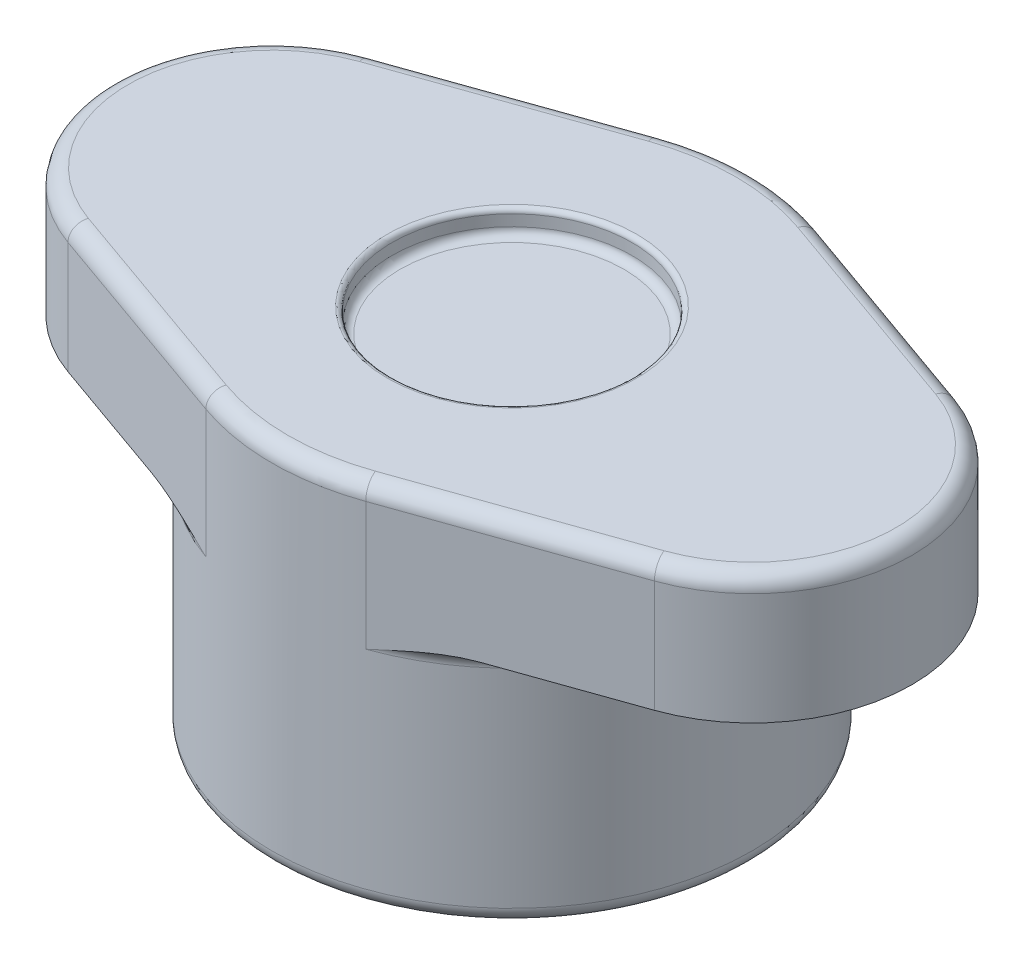
ISO-10303-21;
HEADER;
FILE_DESCRIPTION(('STEP AP214'),'2;1');
FILE_NAME('part.step','',(''),(''),'','','');
FILE_SCHEMA(('AUTOMOTIVE_DESIGN { 1 0 10303 214 1 1 1 1 }'));
ENDSEC;
DATA;
#1=APPLICATION_CONTEXT('core data for automotive mechanical design processes');
#2=APPLICATION_PROTOCOL_DEFINITION('international standard','automotive_design',2000,#1);
#3=PRODUCT_CONTEXT('',#1,'mechanical');
#4=PRODUCT('Part','Part','',(#3));
#5=PRODUCT_RELATED_PRODUCT_CATEGORY('part','',(#4));
#6=PRODUCT_DEFINITION_FORMATION('','',#4);
#7=PRODUCT_DEFINITION_CONTEXT('part definition',#1,'design');
#8=PRODUCT_DEFINITION('design','',#6,#7);
#9=PRODUCT_DEFINITION_SHAPE('','',#8);
#10=(LENGTH_UNIT() NAMED_UNIT(*) SI_UNIT(.MILLI.,.METRE.));
#11=(NAMED_UNIT(*) PLANE_ANGLE_UNIT() SI_UNIT($,.RADIAN.));
#12=(NAMED_UNIT(*) SI_UNIT($,.STERADIAN.) SOLID_ANGLE_UNIT());
#13=UNCERTAINTY_MEASURE_WITH_UNIT(LENGTH_MEASURE(1.E-05),#10,'distance_accuracy_value','');
#14=(GEOMETRIC_REPRESENTATION_CONTEXT(3) GLOBAL_UNCERTAINTY_ASSIGNED_CONTEXT((#13)) GLOBAL_UNIT_ASSIGNED_CONTEXT((#10,
#11,#12)) REPRESENTATION_CONTEXT('',''));
#15=CARTESIAN_POINT('',(0.,0.,0.));
#16=DIRECTION('',(0.,0.,1.));
#17=DIRECTION('',(1.,0.,0.));
#18=AXIS2_PLACEMENT_3D('',#15,#16,#17);
#19=CARTESIAN_POINT('',(0.,15.,0.));
#20=DIRECTION('',(0.,-1.,0.));
#21=DIRECTION('',(0.,0.,-1.));
#22=AXIS2_PLACEMENT_3D('',#19,#20,#21);
#23=CYLINDRICAL_SURFACE('',#22,15.);
#24=CARTESIAN_POINT('',(0.,1.,0.));
#25=DIRECTION('',(0.,1.,0.));
#26=DIRECTION('',(0.,0.,1.));
#27=AXIS2_PLACEMENT_3D('',#24,#25,#26);
#28=CIRCLE('',#27,15.);
#29=CARTESIAN_POINT('',(0.,1.,15.));
#30=VERTEX_POINT('',#29);
#31=EDGE_CURVE('E197',#30,#30,#28,.T.);
#32=ORIENTED_EDGE('',*,*,#31,.T.);
#33=EDGE_LOOP('',(#32));
#34=FACE_BOUND('',#33,.T.);
#35=DIRECTION('',(0.,-1.,0.));
#36=VECTOR('',#35,1.);
#37=CARTESIAN_POINT('',(-5.,23.,-14.142135623731));
#38=LINE('',#37,#36);
#39=CARTESIAN_POINT('',(-5.,22.,-14.142135623731));
#40=VERTEX_POINT('',#39);
#41=CARTESIAN_POINT('',(-5.,14.,-14.142135623731));
#42=VERTEX_POINT('',#41);
#43=EDGE_CURVE('E56',#40,#42,#38,.T.);
#44=ORIENTED_EDGE('',*,*,#43,.F.);
#45=CARTESIAN_POINT('',(0.,22.,0.));
#46=DIRECTION('',(0.,1.,0.));
#47=DIRECTION('',(0.,0.,1.));
#48=AXIS2_PLACEMENT_3D('',#45,#46,#47);
#49=CIRCLE('',#48,15.);
#50=CARTESIAN_POINT('',(5.,22.,-14.1421356237309));
#51=VERTEX_POINT('',#50);
#52=EDGE_CURVE('E195',#40,#51,#49,.F.);
#53=ORIENTED_EDGE('',*,*,#52,.T.);
#54=DIRECTION('',(0.,-1.,0.));
#55=VECTOR('',#54,1.);
#56=CARTESIAN_POINT('',(5.,23.,-14.1421356237309));
#57=LINE('',#56,#55);
#58=CARTESIAN_POINT('',(5.,14.,-14.142135623731));
#59=VERTEX_POINT('',#58);
#60=EDGE_CURVE('E174',#51,#59,#57,.T.);
#61=ORIENTED_EDGE('',*,*,#60,.T.);
#62=CARTESIAN_POINT('',(0.,14.,0.));
#63=DIRECTION('',(0.,1.,0.));
#64=DIRECTION('',(0.,0.,1.));
#65=AXIS2_PLACEMENT_3D('',#62,#63,#64);
#66=CIRCLE('',#65,15.);
#67=CARTESIAN_POINT('',(5.,14.,14.1421356237309));
#68=VERTEX_POINT('',#67);
#69=EDGE_CURVE('E187',#59,#68,#66,.F.);
#70=ORIENTED_EDGE('',*,*,#69,.T.);
#71=DIRECTION('',(0.,-1.,0.));
#72=VECTOR('',#71,1.);
#73=CARTESIAN_POINT('',(5.,23.,14.1421356237309));
#74=LINE('',#73,#72);
#75=CARTESIAN_POINT('',(5.,22.,14.1421356237309));
#76=VERTEX_POINT('',#75);
#77=EDGE_CURVE('E176',#76,#68,#74,.T.);
#78=ORIENTED_EDGE('',*,*,#77,.F.);
#79=CARTESIAN_POINT('',(0.,22.,0.));
#80=DIRECTION('',(0.,1.,0.));
#81=DIRECTION('',(0.,0.,1.));
#82=AXIS2_PLACEMENT_3D('',#79,#80,#81);
#83=CIRCLE('',#82,15.);
#84=CARTESIAN_POINT('',(-5.,22.,14.1421356237309));
#85=VERTEX_POINT('',#84);
#86=EDGE_CURVE('E191',#76,#85,#83,.F.);
#87=ORIENTED_EDGE('',*,*,#86,.T.);
#88=DIRECTION('',(0.,-1.,0.));
#89=VECTOR('',#88,1.);
#90=CARTESIAN_POINT('',(-5.,23.,14.1421356237309));
#91=LINE('',#90,#89);
#92=CARTESIAN_POINT('',(-5.,14.,14.142135623731));
#93=VERTEX_POINT('',#92);
#94=EDGE_CURVE('E48',#85,#93,#91,.T.);
#95=ORIENTED_EDGE('',*,*,#94,.T.);
#96=CARTESIAN_POINT('',(0.,14.,0.));
#97=DIRECTION('',(0.,1.,0.));
#98=DIRECTION('',(0.,0.,1.));
#99=AXIS2_PLACEMENT_3D('',#96,#97,#98);
#100=CIRCLE('',#99,15.);
#101=EDGE_CURVE('E193',#93,#42,#100,.F.);
#102=ORIENTED_EDGE('',*,*,#101,.T.);
#103=EDGE_LOOP('',(#44,#53,#61,#70,#78,#87,#95,#102));
#104=FACE_BOUND('',#103,.T.);
#105=ADVANCED_FACE('F33',(#34,#104),#23,.T.);
#106=CARTESIAN_POINT('',(0.,0.,0.));
#107=DIRECTION('',(0.,1.,0.));
#108=DIRECTION('',(0.,0.,1.));
#109=AXIS2_PLACEMENT_3D('',#106,#107,#108);
#110=PLANE('',#109);
#111=CARTESIAN_POINT('',(0.,0.,0.));
#112=DIRECTION('',(0.,1.,0.));
#113=DIRECTION('',(0.,0.,1.));
#114=AXIS2_PLACEMENT_3D('',#111,#112,#113);
#115=CIRCLE('',#114,14.);
#116=CARTESIAN_POINT('',(0.,0.,14.));
#117=VERTEX_POINT('',#116);
#118=EDGE_CURVE('E200',#117,#117,#115,.F.);
#119=ORIENTED_EDGE('',*,*,#118,.T.);
#120=EDGE_LOOP('',(#119));
#121=FACE_BOUND('',#120,.T.);
#122=ADVANCED_FACE('F269',(#121),#110,.F.);
#123=CARTESIAN_POINT('',(-15.,15.,0.));
#124=DIRECTION('',(0.,1.,0.));
#125=DIRECTION('',(0.,0.,1.));
#126=AXIS2_PLACEMENT_3D('',#123,#124,#125);
#127=PLANE('',#126);
#128=DIRECTION('',(0.942809041582063,0.,-0.333333333333333));
#129=VECTOR('',#128,1.);
#130=CARTESIAN_POINT('',(18.3333333333333,15.,9.42809041582063));
#131=LINE('',#130,#129);
#132=CARTESIAN_POINT('',(10.2493385826745,15.,12.2862141694543));
#133=VERTEX_POINT('',#132);
#134=CARTESIAN_POINT('',(18.3333333333333,15.,9.42809041582063));
#135=VERTEX_POINT('',#134);
#136=EDGE_CURVE('E153',#133,#135,#131,.T.);
#137=ORIENTED_EDGE('',*,*,#136,.F.);
#138=CARTESIAN_POINT('',(0.,15.,0.));
#139=DIRECTION('',(0.,1.,0.));
#140=DIRECTION('',(0.,0.,1.));
#141=AXIS2_PLACEMENT_3D('',#138,#139,#140);
#142=CIRCLE('',#141,16.);
#143=CARTESIAN_POINT('',(10.2493385826745,15.,-12.2862141694543));
#144=VERTEX_POINT('',#143);
#145=EDGE_CURVE('E204',#133,#144,#142,.T.);
#146=ORIENTED_EDGE('',*,*,#145,.T.);
#147=DIRECTION('',(-0.942809041582063,0.,-0.333333333333333));
#148=VECTOR('',#147,1.);
#149=CARTESIAN_POINT('',(18.3333333333333,15.,-9.42809041582063));
#150=LINE('',#149,#148);
#151=CARTESIAN_POINT('',(18.3333333333333,15.,-9.42809041582063));
#152=VERTEX_POINT('',#151);
#153=EDGE_CURVE('E168',#152,#144,#150,.T.);
#154=ORIENTED_EDGE('',*,*,#153,.F.);
#155=CARTESIAN_POINT('',(15.,15.,0.));
#156=DIRECTION('',(0.,1.,0.));
#157=DIRECTION('',(0.,0.,1.));
#158=AXIS2_PLACEMENT_3D('',#155,#156,#157);
#159=CIRCLE('',#158,10.);
#160=EDGE_CURVE('E165',#135,#152,#159,.T.);
#161=ORIENTED_EDGE('',*,*,#160,.F.);
#162=EDGE_LOOP('',(#137,#146,#154,#161));
#163=FACE_BOUND('',#162,.T.);
#164=ADVANCED_FACE('F266',(#163),#127,.F.);
#165=DIRECTION('',(-0.942809041582063,0.,0.333333333333333));
#166=VECTOR('',#165,1.);
#167=CARTESIAN_POINT('',(-18.3333333333333,15.,-9.42809041582063));
#168=LINE('',#167,#166);
#169=CARTESIAN_POINT('',(-10.2493385826745,15.,-12.2862141694543));
#170=VERTEX_POINT('',#169);
#171=CARTESIAN_POINT('',(-18.3333333333333,15.,-9.42809041582063));
#172=VERTEX_POINT('',#171);
#173=EDGE_CURVE('E170',#170,#172,#168,.T.);
#174=ORIENTED_EDGE('',*,*,#173,.F.);
#175=CARTESIAN_POINT('',(0.,15.,0.));
#176=DIRECTION('',(0.,1.,0.));
#177=DIRECTION('',(0.,0.,1.));
#178=AXIS2_PLACEMENT_3D('',#175,#176,#177);
#179=CIRCLE('',#178,16.);
#180=CARTESIAN_POINT('',(-10.2493385826745,15.,12.2862141694543));
#181=VERTEX_POINT('',#180);
#182=EDGE_CURVE('E152',#170,#181,#179,.T.);
#183=ORIENTED_EDGE('',*,*,#182,.T.);
#184=DIRECTION('',(0.942809041582063,0.,0.333333333333333));
#185=VECTOR('',#184,1.);
#186=CARTESIAN_POINT('',(-18.3333333333333,15.,9.42809041582063));
#187=LINE('',#186,#185);
#188=CARTESIAN_POINT('',(-18.3333333333333,15.,9.42809041582063));
#189=VERTEX_POINT('',#188);
#190=EDGE_CURVE('E138',#189,#181,#187,.T.);
#191=ORIENTED_EDGE('',*,*,#190,.F.);
#192=CARTESIAN_POINT('',(-15.,15.,0.));
#193=DIRECTION('',(0.,1.,0.));
#194=DIRECTION('',(0.,0.,1.));
#195=AXIS2_PLACEMENT_3D('',#192,#193,#194);
#196=CIRCLE('',#195,10.);
#197=EDGE_CURVE('E150',#172,#189,#196,.T.);
#198=ORIENTED_EDGE('',*,*,#197,.F.);
#199=EDGE_LOOP('',(#174,#183,#191,#198));
#200=FACE_BOUND('',#199,.T.);
#201=ADVANCED_FACE('F149',(#200),#127,.F.);
#202=CARTESIAN_POINT('',(-15.,23.,0.));
#203=DIRECTION('',(0.,-1.,0.));
#204=DIRECTION('',(0.,0.,-1.));
#205=AXIS2_PLACEMENT_3D('',#202,#203,#204);
#206=CYLINDRICAL_SURFACE('',#205,10.);
#207=DIRECTION('',(0.,-1.,0.));
#208=VECTOR('',#207,1.);
#209=CARTESIAN_POINT('',(-18.3333333333333,23.,9.42809041582063));
#210=LINE('',#209,#208);
#211=CARTESIAN_POINT('',(-18.3333333333333,22.,9.42809041582063));
#212=VERTEX_POINT('',#211);
#213=EDGE_CURVE('E135',#212,#189,#210,.T.);
#214=ORIENTED_EDGE('',*,*,#213,.F.);
#215=CARTESIAN_POINT('',(-15.,22.,0.));
#216=DIRECTION('',(0.,1.,0.));
#217=DIRECTION('',(0.,0.,1.));
#218=AXIS2_PLACEMENT_3D('',#215,#216,#217);
#219=CIRCLE('',#218,10.);
#220=CARTESIAN_POINT('',(-18.3333333333333,22.,-9.42809041582063));
#221=VERTEX_POINT('',#220);
#222=EDGE_CURVE('E389',#212,#221,#219,.F.);
#223=ORIENTED_EDGE('',*,*,#222,.T.);
#224=DIRECTION('',(0.,-1.,0.));
#225=VECTOR('',#224,1.);
#226=CARTESIAN_POINT('',(-18.3333333333333,23.,-9.42809041582063));
#227=LINE('',#226,#225);
#228=EDGE_CURVE('E158',#221,#172,#227,.T.);
#229=ORIENTED_EDGE('',*,*,#228,.T.);
#230=ORIENTED_EDGE('',*,*,#197,.T.);
#231=EDGE_LOOP('',(#214,#223,#229,#230));
#232=FACE_BOUND('',#231,.T.);
#233=ADVANCED_FACE('F156',(#232),#206,.T.);
#234=CARTESIAN_POINT('',(-18.3333333333333,23.,9.42809041582063));
#235=DIRECTION('',(0.333333333333333,0.,-0.942809041582063));
#236=DIRECTION('',(-0.942809041582063,0.,-0.333333333333333));
#237=AXIS2_PLACEMENT_3D('',#234,#235,#236);
#238=PLANE('',#237);
#239=ORIENTED_EDGE('',*,*,#94,.F.);
#240=DIRECTION('',(0.942809041582063,0.,0.333333333333333));
#241=VECTOR('',#240,1.);
#242=CARTESIAN_POINT('',(-18.3333333333333,22.,9.42809041582063));
#243=LINE('',#242,#241);
#244=EDGE_CURVE('E140',#85,#212,#243,.F.);
#245=ORIENTED_EDGE('',*,*,#244,.T.);
#246=ORIENTED_EDGE('',*,*,#213,.T.);
#247=ORIENTED_EDGE('',*,*,#190,.T.);
#248=CARTESIAN_POINT('',(-10.2493385826745,15.,12.2862141694543));
#249=CARTESIAN_POINT('',(-10.1701409998132,14.9999934576055,12.3142147434017));
#250=CARTESIAN_POINT('',(-10.0909526940997,14.9987190814328,12.342212037382));
#251=CARTESIAN_POINT('',(-9.93265017944229,14.9938848919135,12.3981804281786));
#252=CARTESIAN_POINT('',(-9.85353596039774,14.9903254571566,12.4261515285659));
#253=CARTESIAN_POINT('',(-9.61648054789548,14.9766017434484,12.5099632734146));
#254=CARTESIAN_POINT('',(-9.45869407128864,14.9633912056256,12.5657492172087));
#255=CARTESIAN_POINT('',(-9.14432630540418,14.9304388198483,12.6768950067304));
#256=CARTESIAN_POINT('',(-8.98774272255646,14.910720637572,12.7322556633575));
#257=CARTESIAN_POINT('',(-8.67523136095406,14.8659074262227,12.8427451148509));
#258=CARTESIAN_POINT('',(-8.51930375276896,14.8408110773528,12.8978738494118));
#259=CARTESIAN_POINT('',(-8.08208084850818,14.7641132406871,13.0524554896583));
#260=CARTESIAN_POINT('',(-7.80156961081257,14.7075113950913,13.1516311888451));
#261=CARTESIAN_POINT('',(-7.24249870395149,14.5844770809805,13.3492926035479));
#262=CARTESIAN_POINT('',(-6.96393923790269,14.5180436047678,13.4477782472513));
#263=CARTESIAN_POINT('',(-6.12960915073213,14.3093090217507,13.7427584784444));
#264=CARTESIAN_POINT('',(-5.57594218631399,14.1577276465325,13.9385093109739));
#265=CARTESIAN_POINT('',(-5.01490711122545,14.0040824578201,14.1368651640132));
#266=CARTESIAN_POINT('',(-5.00745355118174,14.002041215896,14.1395003954387));
#267=CARTESIAN_POINT('',(-5.,14.,14.1421356237309));
#268=B_SPLINE_CURVE_WITH_KNOTS('',3,(#248,#249,#250,#251,#252,#253,#254,#255,#256,#257,#258,
#259,#260,#261,#262,#263,#264,#265,#266,#267),.UNSPECIFIED.,.F.,.F.,(4,2,2,2,2,2,2,2,2,4),(0.,
0.251980283474248,0.503918829490459,1.00737471305319,1.5090195417815,2.0107876149163,
2.91909735932634,3.82750026595785,5.64675090365133,5.67124580107916),.UNSPECIFIED.);
#269=EDGE_CURVE('E207',#181,#93,#268,.T.);
#270=ORIENTED_EDGE('',*,*,#269,.T.);
#271=EDGE_LOOP('',(#239,#245,#246,#247,#270));
#272=FACE_BOUND('',#271,.T.);
#273=ADVANCED_FACE('F137',(#272),#238,.F.);
#274=CARTESIAN_POINT('',(18.3333333333333,23.,9.42809041582063));
#275=DIRECTION('',(-0.333333333333333,0.,-0.942809041582063));
#276=DIRECTION('',(-0.942809041582063,0.,0.333333333333333));
#277=AXIS2_PLACEMENT_3D('',#274,#275,#276);
#278=PLANE('',#277);
#279=DIRECTION('',(0.,-1.,0.));
#280=VECTOR('',#279,1.);
#281=CARTESIAN_POINT('',(18.3333333333333,23.,9.42809041582063));
#282=LINE('',#281,#280);
#283=CARTESIAN_POINT('',(18.3333333333333,22.,9.42809041582063));
#284=VERTEX_POINT('',#283);
#285=EDGE_CURVE('E173',#284,#135,#282,.T.);
#286=ORIENTED_EDGE('',*,*,#285,.F.);
#287=DIRECTION('',(0.942809041582063,0.,-0.333333333333333));
#288=VECTOR('',#287,1.);
#289=CARTESIAN_POINT('',(5.,22.,14.1421356237309));
#290=LINE('',#289,#288);
#291=EDGE_CURVE('E185',#284,#76,#290,.F.);
#292=ORIENTED_EDGE('',*,*,#291,.T.);
#293=ORIENTED_EDGE('',*,*,#77,.T.);
#294=CARTESIAN_POINT('',(10.2493385826745,15.,12.2862141694543));
#295=CARTESIAN_POINT('',(10.1701409998132,14.9999934576055,12.3142147434017));
#296=CARTESIAN_POINT('',(10.0909526940997,14.9987190814328,12.342212037382));
#297=CARTESIAN_POINT('',(9.93265017944231,14.9938848919135,12.3981804281786));
#298=CARTESIAN_POINT('',(9.85353596039777,14.9903254571566,12.4261515285659));
#299=CARTESIAN_POINT('',(9.61648054789553,14.9766017434484,12.5099632734146));
#300=CARTESIAN_POINT('',(9.4586940712887,14.9633912056256,12.5657492172087));
#301=CARTESIAN_POINT('',(9.14432630540424,14.9304388198483,12.6768950067304));
#302=CARTESIAN_POINT('',(8.9877427225565,14.910720637572,12.7322556633574));
#303=CARTESIAN_POINT('',(8.67523136095408,14.8659074262227,12.8427451148509));
#304=CARTESIAN_POINT('',(8.51930375276898,14.8408110773528,12.8978738494118));
#305=CARTESIAN_POINT('',(8.08208084850818,14.7641132406871,13.0524554896583));
#306=CARTESIAN_POINT('',(7.80156961081255,14.7075113950913,13.1516311888451));
#307=CARTESIAN_POINT('',(7.24249870395149,14.5844770809805,13.3492926035479));
#308=CARTESIAN_POINT('',(6.9639392379027,14.5180436047676,13.4477782472513));
#309=CARTESIAN_POINT('',(6.12960915073205,14.3093090217509,13.7427584784444));
#310=CARTESIAN_POINT('',(5.57594218631366,14.1577276465338,13.938509310974));
#311=CARTESIAN_POINT('',(5.01490711122544,14.0040824578201,14.1368651640132));
#312=CARTESIAN_POINT('',(5.00745355118173,14.002041215896,14.1395003954387));
#313=CARTESIAN_POINT('',(5.,14.,14.142135623731));
#314=B_SPLINE_CURVE_WITH_KNOTS('',3,(#294,#295,#296,#297,#298,#299,#300,#301,#302,#303,#304,
#305,#306,#307,#308,#309,#310,#311,#312,#313),.UNSPECIFIED.,.F.,.F.,(4,2,2,2,2,2,2,2,2,4),(0.,
0.251980283474229,0.503918829490417,1.00737471305311,1.50901954178146,2.0107876149163,
2.91909735932635,3.82750026595788,5.64675090365133,5.67124580107916),.UNSPECIFIED.);
#315=EDGE_CURVE('E242',#68,#133,#314,.F.);
#316=ORIENTED_EDGE('',*,*,#315,.T.);
#317=ORIENTED_EDGE('',*,*,#136,.T.);
#318=EDGE_LOOP('',(#286,#292,#293,#316,#317));
#319=FACE_BOUND('',#318,.T.);
#320=ADVANCED_FACE('F249',(#319),#278,.F.);
#321=CARTESIAN_POINT('',(15.,23.,0.));
#322=DIRECTION('',(0.,-1.,0.));
#323=DIRECTION('',(0.,0.,-1.));
#324=AXIS2_PLACEMENT_3D('',#321,#322,#323);
#325=CYLINDRICAL_SURFACE('',#324,10.);
#326=DIRECTION('',(0.,-1.,0.));
#327=VECTOR('',#326,1.);
#328=CARTESIAN_POINT('',(18.3333333333333,23.,-9.42809041582063));
#329=LINE('',#328,#327);
#330=CARTESIAN_POINT('',(18.3333333333333,22.,-9.42809041582063));
#331=VERTEX_POINT('',#330);
#332=EDGE_CURVE('E171',#331,#152,#329,.T.);
#333=ORIENTED_EDGE('',*,*,#332,.F.);
#334=CARTESIAN_POINT('',(15.,22.,0.));
#335=DIRECTION('',(0.,1.,0.));
#336=DIRECTION('',(0.,0.,1.));
#337=AXIS2_PLACEMENT_3D('',#334,#335,#336);
#338=CIRCLE('',#337,10.);
#339=EDGE_CURVE('E188',#331,#284,#338,.F.);
#340=ORIENTED_EDGE('',*,*,#339,.T.);
#341=ORIENTED_EDGE('',*,*,#285,.T.);
#342=ORIENTED_EDGE('',*,*,#160,.T.);
#343=EDGE_LOOP('',(#333,#340,#341,#342));
#344=FACE_BOUND('',#343,.T.);
#345=ADVANCED_FACE('F253',(#344),#325,.T.);
#346=CARTESIAN_POINT('',(18.3333333333333,23.,-9.42809041582063));
#347=DIRECTION('',(-0.333333333333333,0.,0.942809041582063));
#348=DIRECTION('',(0.942809041582063,0.,0.333333333333333));
#349=AXIS2_PLACEMENT_3D('',#346,#347,#348);
#350=PLANE('',#349);
#351=ORIENTED_EDGE('',*,*,#60,.F.);
#352=DIRECTION('',(-0.942809041582063,0.,-0.333333333333333));
#353=VECTOR('',#352,1.);
#354=CARTESIAN_POINT('',(18.3333333333333,22.,-9.42809041582063));
#355=LINE('',#354,#353);
#356=EDGE_CURVE('E336',#51,#331,#355,.F.);
#357=ORIENTED_EDGE('',*,*,#356,.T.);
#358=ORIENTED_EDGE('',*,*,#332,.T.);
#359=ORIENTED_EDGE('',*,*,#153,.T.);
#360=CARTESIAN_POINT('',(10.2493385826745,15.,-12.2862141694543));
#361=CARTESIAN_POINT('',(10.1701409998132,14.9999934576055,-12.3142147434017));
#362=CARTESIAN_POINT('',(10.0909526940997,14.9987190814328,-12.342212037382));
#363=CARTESIAN_POINT('',(9.93265017944229,14.9938848919135,-12.3981804281786));
#364=CARTESIAN_POINT('',(9.85353596039774,14.9903254571566,-12.4261515285659));
#365=CARTESIAN_POINT('',(9.61648054789548,14.9766017434484,-12.5099632734146));
#366=CARTESIAN_POINT('',(9.45869407128864,14.9633912056256,-12.5657492172087));
#367=CARTESIAN_POINT('',(9.14432630540418,14.9304388198483,-12.6768950067304));
#368=CARTESIAN_POINT('',(8.98774272255646,14.910720637572,-12.7322556633575));
#369=CARTESIAN_POINT('',(8.67523136095406,14.8659074262227,-12.8427451148509));
#370=CARTESIAN_POINT('',(8.51930375276896,14.8408110773528,-12.8978738494118));
#371=CARTESIAN_POINT('',(8.08208084850818,14.7641132406871,-13.0524554896583));
#372=CARTESIAN_POINT('',(7.80156961081257,14.7075113950913,-13.1516311888451));
#373=CARTESIAN_POINT('',(7.24249870395149,14.5844770809805,-13.3492926035479));
#374=CARTESIAN_POINT('',(6.96393923790269,14.5180436047678,-13.4477782472513));
#375=CARTESIAN_POINT('',(6.12960915073213,14.3093090217507,-13.7427584784444));
#376=CARTESIAN_POINT('',(5.57594218631399,14.1577276465325,-13.9385093109739));
#377=CARTESIAN_POINT('',(5.01490711122545,14.0040824578201,-14.1368651640132));
#378=CARTESIAN_POINT('',(5.00745355118174,14.002041215896,-14.1395003954387));
#379=CARTESIAN_POINT('',(5.,14.,-14.1421356237309));
#380=B_SPLINE_CURVE_WITH_KNOTS('',3,(#360,#361,#362,#363,#364,#365,#366,#367,#368,#369,#370,
#371,#372,#373,#374,#375,#376,#377,#378,#379),.UNSPECIFIED.,.F.,.F.,(4,2,2,2,2,2,2,2,2,4),(0.,
0.251980283474248,0.503918829490459,1.00737471305319,1.5090195417815,2.0107876149163,
2.91909735932634,3.82750026595785,5.64675090365133,5.67124580107916),.UNSPECIFIED.);
#381=EDGE_CURVE('E236',#144,#59,#380,.T.);
#382=ORIENTED_EDGE('',*,*,#381,.T.);
#383=EDGE_LOOP('',(#351,#357,#358,#359,#382));
#384=FACE_BOUND('',#383,.T.);
#385=ADVANCED_FACE('F256',(#384),#350,.F.);
#386=CARTESIAN_POINT('',(-18.3333333333333,23.,-9.42809041582063));
#387=DIRECTION('',(0.333333333333333,0.,0.942809041582063));
#388=DIRECTION('',(0.942809041582063,0.,-0.333333333333333));
#389=AXIS2_PLACEMENT_3D('',#386,#387,#388);
#390=PLANE('',#389);
#391=ORIENTED_EDGE('',*,*,#228,.F.);
#392=DIRECTION('',(-0.942809041582063,0.,0.333333333333333));
#393=VECTOR('',#392,1.);
#394=CARTESIAN_POINT('',(-5.,22.,-14.1421356237309));
#395=LINE('',#394,#393);
#396=EDGE_CURVE('E347',#221,#40,#395,.F.);
#397=ORIENTED_EDGE('',*,*,#396,.T.);
#398=ORIENTED_EDGE('',*,*,#43,.T.);
#399=CARTESIAN_POINT('',(-10.2493385826745,15.,-12.2862141694543));
#400=CARTESIAN_POINT('',(-10.1701409998131,14.9999934576055,-12.3142147434017));
#401=CARTESIAN_POINT('',(-10.0909526940997,14.9987190814328,-12.3422120373821));
#402=CARTESIAN_POINT('',(-9.93265017944223,14.9938848919135,-12.3981804281786));
#403=CARTESIAN_POINT('',(-9.85353596039768,14.9903254571566,-12.426151528566));
#404=CARTESIAN_POINT('',(-9.61648054789538,14.9766017434484,-12.5099632734146));
#405=CARTESIAN_POINT('',(-9.45869407128853,14.9633912056256,-12.5657492172088));
#406=CARTESIAN_POINT('',(-9.14432630540408,14.9304388198483,-12.6768950067304));
#407=CARTESIAN_POINT('',(-8.98774272255637,14.910720637572,-12.7322556633575));
#408=CARTESIAN_POINT('',(-8.67523136095402,14.8659074262227,-12.8427451148509));
#409=CARTESIAN_POINT('',(-8.51930375276894,14.8408110773528,-12.8978738494119));
#410=CARTESIAN_POINT('',(-8.08208084850819,14.7641132406871,-13.0524554896583));
#411=CARTESIAN_POINT('',(-7.80156961081259,14.7075113950912,-13.1516311888451));
#412=CARTESIAN_POINT('',(-7.24249870395151,14.5844770809806,-13.3492926035479));
#413=CARTESIAN_POINT('',(-6.96393923790268,14.518043604768,-13.4477782472513));
#414=CARTESIAN_POINT('',(-6.12960915073228,14.3093090217503,-13.7427584784444));
#415=CARTESIAN_POINT('',(-5.57594218631461,14.1577276465301,-13.9385093109737));
#416=CARTESIAN_POINT('',(-5.01490711122547,14.00408245782,-14.1368651640132));
#417=CARTESIAN_POINT('',(-5.00745355118175,14.0020412158959,-14.1395003954387));
#418=CARTESIAN_POINT('',(-5.,14.,-14.1421356237309));
#419=B_SPLINE_CURVE_WITH_KNOTS('',3,(#399,#400,#401,#402,#403,#404,#405,#406,#407,#408,#409,
#410,#411,#412,#413,#414,#415,#416,#417,#418),.UNSPECIFIED.,.F.,.F.,(4,2,2,2,2,2,2,2,2,4),(0.,
0.25198028347429,0.503918829490538,1.00737471305333,1.50901954178156,2.0107876149163,
2.91909735932632,3.82750026595778,5.64675090365132,5.67124580107916),.UNSPECIFIED.);
#420=EDGE_CURVE('E214',#42,#170,#419,.F.);
#421=ORIENTED_EDGE('',*,*,#420,.T.);
#422=ORIENTED_EDGE('',*,*,#173,.T.);
#423=EDGE_LOOP('',(#391,#397,#398,#421,#422));
#424=FACE_BOUND('',#423,.T.);
#425=ADVANCED_FACE('F260',(#424),#390,.F.);
#426=CARTESIAN_POINT('',(-15.,23.,0.));
#427=DIRECTION('',(0.,1.,0.));
#428=DIRECTION('',(0.,0.,1.));
#429=AXIS2_PLACEMENT_3D('',#426,#427,#428);
#430=PLANE('',#429);
#431=CARTESIAN_POINT('',(0.,23.,0.));
#432=DIRECTION('',(0.,1.,0.));
#433=DIRECTION('',(0.,0.,1.));
#434=AXIS2_PLACEMENT_3D('',#431,#432,#433);
#435=CIRCLE('',#434,7.8);
#436=CARTESIAN_POINT('',(0.,23.,7.8));
#437=VERTEX_POINT('',#436);
#438=EDGE_CURVE('E11',#437,#437,#435,.F.);
#439=ORIENTED_EDGE('',*,*,#438,.T.);
#440=EDGE_LOOP('',(#439));
#441=FACE_BOUND('',#440,.T.);
#442=DIRECTION('',(-0.942809041582063,0.,0.333333333333333));
#443=VECTOR('',#442,1.);
#444=CARTESIAN_POINT('',(-18.,23.,-8.48528137423857));
#445=LINE('',#444,#443);
#446=CARTESIAN_POINT('',(-4.66666666666666,23.,-13.1993265821489));
#447=VERTEX_POINT('',#446);
#448=CARTESIAN_POINT('',(-18.,23.,-8.48528137423857));
#449=VERTEX_POINT('',#448);
#450=EDGE_CURVE('E374',#447,#449,#445,.T.);
#451=ORIENTED_EDGE('',*,*,#450,.T.);
#452=CARTESIAN_POINT('',(-15.,23.,0.));
#453=DIRECTION('',(0.,1.,0.));
#454=DIRECTION('',(0.,0.,1.));
#455=AXIS2_PLACEMENT_3D('',#452,#453,#454);
#456=CIRCLE('',#455,9.);
#457=CARTESIAN_POINT('',(-18.,23.,8.48528137423857));
#458=VERTEX_POINT('',#457);
#459=EDGE_CURVE('E376',#449,#458,#456,.T.);
#460=ORIENTED_EDGE('',*,*,#459,.T.);
#461=DIRECTION('',(0.942809041582063,0.,0.333333333333333));
#462=VECTOR('',#461,1.);
#463=CARTESIAN_POINT('',(-4.66666666666666,23.,13.1993265821489));
#464=LINE('',#463,#462);
#465=CARTESIAN_POINT('',(-4.66666666666667,23.,13.1993265821489));
#466=VERTEX_POINT('',#465);
#467=EDGE_CURVE('E369',#458,#466,#464,.T.);
#468=ORIENTED_EDGE('',*,*,#467,.T.);
#469=CARTESIAN_POINT('',(0.,23.,0.));
#470=DIRECTION('',(0.,1.,0.));
#471=DIRECTION('',(0.,0.,1.));
#472=AXIS2_PLACEMENT_3D('',#469,#470,#471);
#473=CIRCLE('',#472,14.);
#474=CARTESIAN_POINT('',(4.66666666666666,23.,13.1993265821489));
#475=VERTEX_POINT('',#474);
#476=EDGE_CURVE('E362',#466,#475,#473,.T.);
#477=ORIENTED_EDGE('',*,*,#476,.T.);
#478=DIRECTION('',(0.942809041582063,0.,-0.333333333333333));
#479=VECTOR('',#478,1.);
#480=CARTESIAN_POINT('',(18.,23.,8.48528137423856));
#481=LINE('',#480,#479);
#482=CARTESIAN_POINT('',(18.,23.,8.48528137423857));
#483=VERTEX_POINT('',#482);
#484=EDGE_CURVE('E364',#475,#483,#481,.T.);
#485=ORIENTED_EDGE('',*,*,#484,.T.);
#486=CARTESIAN_POINT('',(15.,23.,0.));
#487=DIRECTION('',(0.,1.,0.));
#488=DIRECTION('',(0.,0.,1.));
#489=AXIS2_PLACEMENT_3D('',#486,#487,#488);
#490=CIRCLE('',#489,9.);
#491=CARTESIAN_POINT('',(18.,23.,-8.48528137423857));
#492=VERTEX_POINT('',#491);
#493=EDGE_CURVE('E366',#483,#492,#490,.T.);
#494=ORIENTED_EDGE('',*,*,#493,.T.);
#495=DIRECTION('',(-0.942809041582063,0.,-0.333333333333333));
#496=VECTOR('',#495,1.);
#497=CARTESIAN_POINT('',(4.66666666666667,23.,-13.1993265821489));
#498=LINE('',#497,#496);
#499=CARTESIAN_POINT('',(4.66666666666666,23.,-13.1993265821489));
#500=VERTEX_POINT('',#499);
#501=EDGE_CURVE('E337',#492,#500,#498,.T.);
#502=ORIENTED_EDGE('',*,*,#501,.T.);
#503=CARTESIAN_POINT('',(0.,23.,0.));
#504=DIRECTION('',(0.,1.,0.));
#505=DIRECTION('',(0.,0.,1.));
#506=AXIS2_PLACEMENT_3D('',#503,#504,#505);
#507=CIRCLE('',#506,14.);
#508=EDGE_CURVE('E372',#500,#447,#507,.T.);
#509=ORIENTED_EDGE('',*,*,#508,.T.);
#510=EDGE_LOOP('',(#451,#460,#468,#477,#485,#494,#502,#509));
#511=FACE_BOUND('',#510,.T.);
#512=ADVANCED_FACE('F265',(#441,#511),#430,.T.);
#513=CARTESIAN_POINT('',(0.,21.5,0.));
#514=DIRECTION('',(0.,1.,0.));
#515=DIRECTION('',(0.,0.,1.));
#516=AXIS2_PLACEMENT_3D('',#513,#514,#515);
#517=CYLINDRICAL_SURFACE('',#516,7.5);
#518=CARTESIAN_POINT('',(0.,22.7,0.));
#519=DIRECTION('',(0.,1.,0.));
#520=DIRECTION('',(0.,0.,1.));
#521=AXIS2_PLACEMENT_3D('',#518,#519,#520);
#522=CIRCLE('',#521,7.5);
#523=CARTESIAN_POINT('',(0.,22.7,7.5));
#524=VERTEX_POINT('',#523);
#525=EDGE_CURVE('E41',#524,#524,#522,.T.);
#526=ORIENTED_EDGE('',*,*,#525,.T.);
#527=EDGE_LOOP('',(#526));
#528=FACE_BOUND('',#527,.T.);
#529=CARTESIAN_POINT('',(0.,22.,0.));
#530=DIRECTION('',(0.,1.,0.));
#531=DIRECTION('',(0.,0.,1.));
#532=AXIS2_PLACEMENT_3D('',#529,#530,#531);
#533=CIRCLE('',#532,7.5);
#534=CARTESIAN_POINT('',(0.,22.,7.5));
#535=VERTEX_POINT('',#534);
#536=EDGE_CURVE('E359',#535,#535,#533,.F.);
#537=ORIENTED_EDGE('',*,*,#536,.T.);
#538=EDGE_LOOP('',(#537));
#539=FACE_BOUND('',#538,.T.);
#540=ADVANCED_FACE('F273',(#528,#539),#517,.F.);
#541=CARTESIAN_POINT('',(0.,21.5,0.));
#542=DIRECTION('',(0.,1.,0.));
#543=DIRECTION('',(0.,0.,1.));
#544=AXIS2_PLACEMENT_3D('',#541,#542,#543);
#545=PLANE('',#544);
#546=CARTESIAN_POINT('',(0.,21.5,0.));
#547=DIRECTION('',(0.,1.,0.));
#548=DIRECTION('',(0.,0.,1.));
#549=AXIS2_PLACEMENT_3D('',#546,#547,#548);
#550=CIRCLE('',#549,7.);
#551=CARTESIAN_POINT('',(0.,21.5,7.));
#552=VERTEX_POINT('',#551);
#553=EDGE_CURVE('E143',#552,#552,#550,.T.);
#554=ORIENTED_EDGE('',*,*,#553,.T.);
#555=EDGE_LOOP('',(#554));
#556=FACE_BOUND('',#555,.T.);
#557=ADVANCED_FACE('F277',(#556),#545,.T.);
#558=CARTESIAN_POINT('',(0.,22.,0.));
#559=DIRECTION('',(0.,1.,0.));
#560=DIRECTION('',(0.,0.,1.));
#561=AXIS2_PLACEMENT_3D('',#558,#559,#560);
#562=TOROIDAL_SURFACE('',#561,7.,0.5);
#563=ORIENTED_EDGE('',*,*,#536,.F.);
#564=EDGE_LOOP('',(#563));
#565=FACE_BOUND('',#564,.T.);
#566=ORIENTED_EDGE('',*,*,#553,.F.);
#567=EDGE_LOOP('',(#566));
#568=FACE_BOUND('',#567,.T.);
#569=ADVANCED_FACE('F280',(#565,#568),#562,.F.);
#570=CARTESIAN_POINT('',(-8.66666666666667,22.,-17.9133717900592));
#571=DIRECTION('',(0.942809041582063,0.,0.333333333333333));
#572=DIRECTION('',(0.333333333333333,0.,-0.942809041582063));
#573=AXIS2_PLACEMENT_3D('',#570,#571,#572);
#574=CYLINDRICAL_SURFACE('',#573,1.);
#575=CARTESIAN_POINT('',(18.,22.,-8.48528137423857));
#576=DIRECTION('',(0.942809041582063,0.,0.333333333333335));
#577=DIRECTION('',(0.333333333333335,0.,-0.942809041582063));
#578=AXIS2_PLACEMENT_3D('',#575,#576,#577);
#579=CIRCLE('',#578,1.);
#580=EDGE_CURVE('E162',#331,#492,#579,.T.);
#581=ORIENTED_EDGE('',*,*,#580,.F.);
#582=ORIENTED_EDGE('',*,*,#356,.F.);
#583=CARTESIAN_POINT('',(4.66666666666666,22.,-13.1993265821489));
#584=DIRECTION('',(-0.942809041582064,0.,-0.333333333333333));
#585=DIRECTION('',(-0.333333333333333,0.,0.942809041582064));
#586=AXIS2_PLACEMENT_3D('',#583,#584,#585);
#587=CIRCLE('',#586,1.);
#588=EDGE_CURVE('E159',#500,#51,#587,.T.);
#589=ORIENTED_EDGE('',*,*,#588,.F.);
#590=ORIENTED_EDGE('',*,*,#501,.F.);
#591=EDGE_LOOP('',(#581,#582,#589,#590));
#592=FACE_BOUND('',#591,.T.);
#593=ADVANCED_FACE('F286',(#592),#574,.T.);
#594=CARTESIAN_POINT('',(0.,22.,0.));
#595=DIRECTION('',(0.,1.,0.));
#596=DIRECTION('',(0.,0.,1.));
#597=AXIS2_PLACEMENT_3D('',#594,#595,#596);
#598=TOROIDAL_SURFACE('',#597,14.,1.);
#599=ORIENTED_EDGE('',*,*,#588,.T.);
#600=ORIENTED_EDGE('',*,*,#52,.F.);
#601=CARTESIAN_POINT('',(-4.66666666666666,22.,-13.1993265821489));
#602=DIRECTION('',(-0.942809041582063,0.,0.333333333333333));
#603=DIRECTION('',(0.333333333333333,0.,0.942809041582063));
#604=AXIS2_PLACEMENT_3D('',#601,#602,#603);
#605=CIRCLE('',#604,1.);
#606=EDGE_CURVE('E339',#447,#40,#605,.T.);
#607=ORIENTED_EDGE('',*,*,#606,.F.);
#608=ORIENTED_EDGE('',*,*,#508,.F.);
#609=EDGE_LOOP('',(#599,#600,#607,#608));
#610=FACE_BOUND('',#609,.T.);
#611=ADVANCED_FACE('F322',(#610),#598,.T.);
#612=CARTESIAN_POINT('',(15.,22.,0.));
#613=DIRECTION('',(0.,1.,0.));
#614=DIRECTION('',(0.,0.,1.));
#615=AXIS2_PLACEMENT_3D('',#612,#613,#614);
#616=TOROIDAL_SURFACE('',#615,9.,1.);
#617=ORIENTED_EDGE('',*,*,#580,.T.);
#618=ORIENTED_EDGE('',*,*,#493,.F.);
#619=CARTESIAN_POINT('',(18.,22.,8.48528137423857));
#620=DIRECTION('',(-0.942809041582063,0.,0.333333333333335));
#621=DIRECTION('',(0.333333333333335,0.,0.942809041582063));
#622=AXIS2_PLACEMENT_3D('',#619,#620,#621);
#623=CIRCLE('',#622,1.);
#624=EDGE_CURVE('E343',#284,#483,#623,.T.);
#625=ORIENTED_EDGE('',*,*,#624,.F.);
#626=ORIENTED_EDGE('',*,*,#339,.F.);
#627=EDGE_LOOP('',(#617,#618,#625,#626));
#628=FACE_BOUND('',#627,.T.);
#629=ADVANCED_FACE('F318',(#628),#616,.T.);
#630=CARTESIAN_POINT('',(-18.,22.,-8.48528137423857));
#631=DIRECTION('',(0.942809041582063,0.,-0.333333333333333));
#632=DIRECTION('',(-0.333333333333333,0.,-0.942809041582063));
#633=AXIS2_PLACEMENT_3D('',#630,#631,#632);
#634=CYLINDRICAL_SURFACE('',#633,1.);
#635=ORIENTED_EDGE('',*,*,#606,.T.);
#636=ORIENTED_EDGE('',*,*,#396,.F.);
#637=CARTESIAN_POINT('',(-18.,22.,-8.48528137423857));
#638=DIRECTION('',(-0.942809041582063,0.,0.333333333333335));
#639=DIRECTION('',(0.333333333333335,0.,0.942809041582063));
#640=AXIS2_PLACEMENT_3D('',#637,#638,#639);
#641=CIRCLE('',#640,1.);
#642=EDGE_CURVE('E403',#449,#221,#641,.T.);
#643=ORIENTED_EDGE('',*,*,#642,.F.);
#644=ORIENTED_EDGE('',*,*,#450,.F.);
#645=EDGE_LOOP('',(#635,#636,#643,#644));
#646=FACE_BOUND('',#645,.T.);
#647=ADVANCED_FACE('F314',(#646),#634,.T.);
#648=CARTESIAN_POINT('',(-8.66666666666667,22.,17.9133717900592));
#649=DIRECTION('',(-0.942809041582063,0.,0.333333333333333));
#650=DIRECTION('',(0.333333333333333,0.,0.942809041582063));
#651=AXIS2_PLACEMENT_3D('',#648,#649,#650);
#652=CYLINDRICAL_SURFACE('',#651,1.);
#653=ORIENTED_EDGE('',*,*,#624,.T.);
#654=ORIENTED_EDGE('',*,*,#484,.F.);
#655=CARTESIAN_POINT('',(4.66666666666666,22.,13.1993265821489));
#656=DIRECTION('',(-0.942809041582063,0.,0.333333333333333));
#657=DIRECTION('',(0.333333333333333,0.,0.942809041582063));
#658=AXIS2_PLACEMENT_3D('',#655,#656,#657);
#659=CIRCLE('',#658,1.);
#660=EDGE_CURVE('E418',#76,#475,#659,.T.);
#661=ORIENTED_EDGE('',*,*,#660,.F.);
#662=ORIENTED_EDGE('',*,*,#291,.F.);
#663=EDGE_LOOP('',(#653,#654,#661,#662));
#664=FACE_BOUND('',#663,.T.);
#665=ADVANCED_FACE('F310',(#664),#652,.T.);
#666=CARTESIAN_POINT('',(-15.,22.,0.));
#667=DIRECTION('',(0.,1.,0.));
#668=DIRECTION('',(0.,0.,1.));
#669=AXIS2_PLACEMENT_3D('',#666,#667,#668);
#670=TOROIDAL_SURFACE('',#669,9.,1.);
#671=ORIENTED_EDGE('',*,*,#642,.T.);
#672=ORIENTED_EDGE('',*,*,#222,.F.);
#673=CARTESIAN_POINT('',(-18.,22.,8.48528137423857));
#674=DIRECTION('',(0.942809041582063,0.,0.333333333333335));
#675=DIRECTION('',(0.333333333333335,0.,-0.942809041582063));
#676=AXIS2_PLACEMENT_3D('',#673,#674,#675);
#677=CIRCLE('',#676,1.);
#678=EDGE_CURVE('E419',#458,#212,#677,.T.);
#679=ORIENTED_EDGE('',*,*,#678,.F.);
#680=ORIENTED_EDGE('',*,*,#459,.F.);
#681=EDGE_LOOP('',(#671,#672,#679,#680));
#682=FACE_BOUND('',#681,.T.);
#683=ADVANCED_FACE('F306',(#682),#670,.T.);
#684=CARTESIAN_POINT('',(0.,22.,0.));
#685=DIRECTION('',(0.,1.,0.));
#686=DIRECTION('',(0.,0.,1.));
#687=AXIS2_PLACEMENT_3D('',#684,#685,#686);
#688=TOROIDAL_SURFACE('',#687,14.,1.);
#689=ORIENTED_EDGE('',*,*,#660,.T.);
#690=ORIENTED_EDGE('',*,*,#476,.F.);
#691=CARTESIAN_POINT('',(-4.66666666666667,22.,13.1993265821489));
#692=DIRECTION('',(-0.942809041582063,0.,-0.333333333333333));
#693=DIRECTION('',(-0.333333333333333,0.,0.942809041582063));
#694=AXIS2_PLACEMENT_3D('',#691,#692,#693);
#695=CIRCLE('',#694,1.);
#696=EDGE_CURVE('E247',#85,#466,#695,.T.);
#697=ORIENTED_EDGE('',*,*,#696,.F.);
#698=ORIENTED_EDGE('',*,*,#86,.F.);
#699=EDGE_LOOP('',(#689,#690,#697,#698));
#700=FACE_BOUND('',#699,.T.);
#701=ADVANCED_FACE('F302',(#700),#688,.T.);
#702=CARTESIAN_POINT('',(-18.,22.,8.48528137423857));
#703=DIRECTION('',(-0.942809041582063,0.,-0.333333333333333));
#704=DIRECTION('',(-0.333333333333333,0.,0.942809041582063));
#705=AXIS2_PLACEMENT_3D('',#702,#703,#704);
#706=CYLINDRICAL_SURFACE('',#705,1.);
#707=ORIENTED_EDGE('',*,*,#678,.T.);
#708=ORIENTED_EDGE('',*,*,#244,.F.);
#709=ORIENTED_EDGE('',*,*,#696,.T.);
#710=ORIENTED_EDGE('',*,*,#467,.F.);
#711=EDGE_LOOP('',(#707,#708,#709,#710));
#712=FACE_BOUND('',#711,.T.);
#713=ADVANCED_FACE('F299',(#712),#706,.T.);
#714=CARTESIAN_POINT('',(0.,1.,0.));
#715=DIRECTION('',(0.,1.,0.));
#716=DIRECTION('',(0.,0.,1.));
#717=AXIS2_PLACEMENT_3D('',#714,#715,#716);
#718=TOROIDAL_SURFACE('',#717,14.,1.);
#719=ORIENTED_EDGE('',*,*,#118,.F.);
#720=EDGE_LOOP('',(#719));
#721=FACE_BOUND('',#720,.T.);
#722=ORIENTED_EDGE('',*,*,#31,.F.);
#723=EDGE_LOOP('',(#722));
#724=FACE_BOUND('',#723,.T.);
#725=ADVANCED_FACE('F228',(#721,#724),#718,.T.);
#726=CARTESIAN_POINT('',(0.,14.,0.));
#727=DIRECTION('',(0.,1.,0.));
#728=DIRECTION('',(0.,0.,1.));
#729=AXIS2_PLACEMENT_3D('',#726,#727,#728);
#730=TOROIDAL_SURFACE('',#729,16.,1.);
#731=ORIENTED_EDGE('',*,*,#420,.F.);
#732=ORIENTED_EDGE('',*,*,#101,.F.);
#733=ORIENTED_EDGE('',*,*,#269,.F.);
#734=ORIENTED_EDGE('',*,*,#182,.F.);
#735=EDGE_LOOP('',(#731,#732,#733,#734));
#736=FACE_BOUND('',#735,.T.);
#737=ADVANCED_FACE('F223',(#736),#730,.F.);
#738=CARTESIAN_POINT('',(0.,14.,0.));
#739=DIRECTION('',(0.,1.,0.));
#740=DIRECTION('',(0.,0.,1.));
#741=AXIS2_PLACEMENT_3D('',#738,#739,#740);
#742=TOROIDAL_SURFACE('',#741,16.,1.);
#743=ORIENTED_EDGE('',*,*,#315,.F.);
#744=ORIENTED_EDGE('',*,*,#69,.F.);
#745=ORIENTED_EDGE('',*,*,#381,.F.);
#746=ORIENTED_EDGE('',*,*,#145,.F.);
#747=EDGE_LOOP('',(#743,#744,#745,#746));
#748=FACE_BOUND('',#747,.T.);
#749=ADVANCED_FACE('F227',(#748),#742,.F.);
#750=CARTESIAN_POINT('',(0.,22.7,0.));
#751=DIRECTION('',(0.,1.,0.));
#752=DIRECTION('',(0.,0.,1.));
#753=AXIS2_PLACEMENT_3D('',#750,#751,#752);
#754=TOROIDAL_SURFACE('',#753,7.8,0.3);
#755=ORIENTED_EDGE('',*,*,#438,.F.);
#756=EDGE_LOOP('',(#755));
#757=FACE_BOUND('',#756,.T.);
#758=ORIENTED_EDGE('',*,*,#525,.F.);
#759=EDGE_LOOP('',(#758));
#760=FACE_BOUND('',#759,.T.);
#761=ADVANCED_FACE('F35',(#757,#760),#754,.T.);
#762=CLOSED_SHELL('',(#105,#122,#164,#201,#233,#273,#320,#345,#385,#425,#512,#540,#557,#569,
#593,#611,#629,#647,#665,#683,#701,#713,#725,#737,#749,#761));
#763=MANIFOLD_SOLID_BREP('B2',#762);
#764=ADVANCED_BREP_SHAPE_REPRESENTATION('',(#18,#763),#14);
#765=SHAPE_DEFINITION_REPRESENTATION(#9,#764);
ENDSEC;
END-ISO-10303-21;
